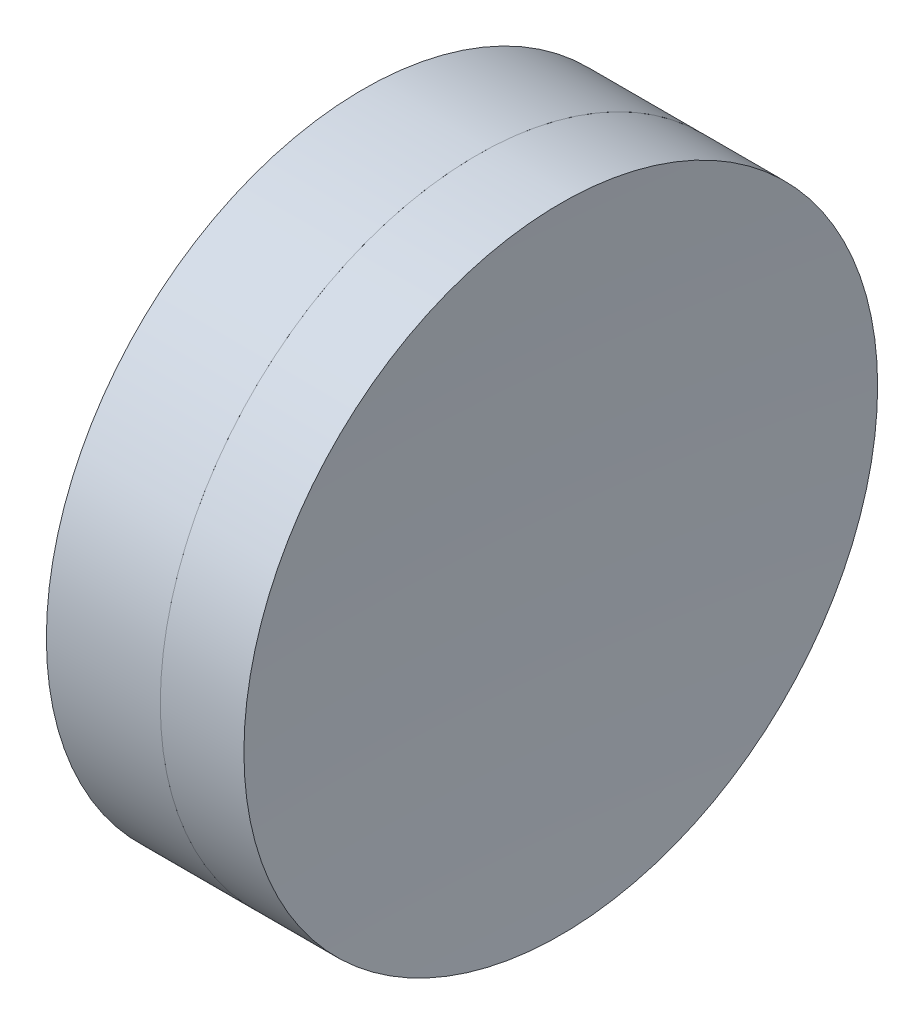
ISO-10303-21;
HEADER;
FILE_DESCRIPTION(('STEP AP214'),'2;1');
FILE_NAME('part.step','',(''),(''),'','','');
FILE_SCHEMA(('AUTOMOTIVE_DESIGN { 1 0 10303 214 1 1 1 1 }'));
ENDSEC;
DATA;
#1=APPLICATION_CONTEXT('core data for automotive mechanical design processes');
#2=APPLICATION_PROTOCOL_DEFINITION('international standard','automotive_design',2000,#1);
#3=PRODUCT_CONTEXT('',#1,'mechanical');
#4=PRODUCT('Part','Part','',(#3));
#5=PRODUCT_RELATED_PRODUCT_CATEGORY('part','',(#4));
#6=PRODUCT_DEFINITION_FORMATION('','',#4);
#7=PRODUCT_DEFINITION_CONTEXT('part definition',#1,'design');
#8=PRODUCT_DEFINITION('design','',#6,#7);
#9=PRODUCT_DEFINITION_SHAPE('','',#8);
#10=(LENGTH_UNIT() NAMED_UNIT(*) SI_UNIT(.MILLI.,.METRE.));
#11=(NAMED_UNIT(*) PLANE_ANGLE_UNIT() SI_UNIT($,.RADIAN.));
#12=(NAMED_UNIT(*) SI_UNIT($,.STERADIAN.) SOLID_ANGLE_UNIT());
#13=UNCERTAINTY_MEASURE_WITH_UNIT(LENGTH_MEASURE(1.E-05),#10,'distance_accuracy_value','');
#14=(GEOMETRIC_REPRESENTATION_CONTEXT(3) GLOBAL_UNCERTAINTY_ASSIGNED_CONTEXT((#13)) GLOBAL_UNIT_ASSIGNED_CONTEXT((#10,
#11,#12)) REPRESENTATION_CONTEXT('',''));
#15=CARTESIAN_POINT('',(0.,0.,0.));
#16=DIRECTION('',(0.,0.,1.));
#17=DIRECTION('',(1.,0.,0.));
#18=AXIS2_PLACEMENT_3D('',#15,#16,#17);
#19=CARTESIAN_POINT('',(289.408136363412,0.,0.));
#20=DIRECTION('',(-1.,0.,0.));
#21=DIRECTION('',(0.,0.,1.));
#22=AXIS2_PLACEMENT_3D('',#19,#20,#21);
#23=SPHERICAL_SURFACE('',#22,68.8700000000006);
#24=CARTESIAN_POINT('',(221.68201953984,0.,0.));
#25=DIRECTION('',(-1.,0.,0.));
#26=DIRECTION('',(0.,0.,1.));
#27=AXIS2_PLACEMENT_3D('',#24,#25,#26);
#28=CIRCLE('',#27,12.5);
#29=CARTESIAN_POINT('',(221.68201953984,0.,12.5));
#30=VERTEX_POINT('',#29);
#31=EDGE_CURVE('E11',#30,#30,#28,.T.);
#32=ORIENTED_EDGE('',*,*,#31,.T.);
#33=EDGE_LOOP('',(#32));
#34=FACE_BOUND('',#33,.T.);
#35=ADVANCED_FACE('F45',(#34),#23,.T.);
#36=CARTESIAN_POINT('',(217.187794645988,0.,0.));
#37=DIRECTION('',(-1.,0.,0.));
#38=DIRECTION('',(0.,0.,1.));
#39=AXIS2_PLACEMENT_3D('',#36,#37,#38);
#40=CYLINDRICAL_SURFACE('',#39,12.5);
#41=CARTESIAN_POINT('',(224.981180013761,0.,0.));
#42=DIRECTION('',(-1.,0.,0.));
#43=DIRECTION('',(0.,0.,1.));
#44=AXIS2_PLACEMENT_3D('',#41,#42,#43);
#45=CIRCLE('',#44,12.5);
#46=CARTESIAN_POINT('',(224.981180013761,0.,12.5));
#47=VERTEX_POINT('',#46);
#48=EDGE_CURVE('E51',#47,#47,#45,.T.);
#49=ORIENTED_EDGE('',*,*,#48,.T.);
#50=EDGE_LOOP('',(#49));
#51=FACE_BOUND('',#50,.T.);
#52=ORIENTED_EDGE('',*,*,#31,.F.);
#53=EDGE_LOOP('',(#52));
#54=FACE_BOUND('',#53,.T.);
#55=ADVANCED_FACE('F57',(#51,#54),#40,.T.);
#56=CARTESIAN_POINT('',(428.748136363411,0.,0.));
#57=DIRECTION('',(-1.,0.,0.));
#58=DIRECTION('',(0.,0.,-1.));
#59=AXIS2_PLACEMENT_3D('',#56,#57,#58);
#60=SPHERICAL_SURFACE('',#59,204.15);
#61=ORIENTED_EDGE('',*,*,#48,.F.);
#62=EDGE_LOOP('',(#61));
#63=FACE_BOUND('',#62,.T.);
#64=ADVANCED_FACE('F60',(#63),#60,.F.);
#65=CLOSED_SHELL('',(#35,#55,#64));
#66=MANIFOLD_SOLID_BREP('B2',#65);
#67=CARTESIAN_POINT('',(125.738136363412,0.,0.));
#68=DIRECTION('',(-1.,0.,0.));
#69=DIRECTION('',(0.,0.,1.));
#70=AXIS2_PLACEMENT_3D('',#67,#68,#69);
#71=SPHERICAL_SURFACE('',#70,92.3);
#72=CARTESIAN_POINT('',(217.187794645988,0.,0.));
#73=DIRECTION('',(-1.,0.,0.));
#74=DIRECTION('',(0.,0.,1.));
#75=AXIS2_PLACEMENT_3D('',#72,#73,#74);
#76=CIRCLE('',#75,12.5);
#77=CARTESIAN_POINT('',(217.187794645988,0.,12.5));
#78=VERTEX_POINT('',#77);
#79=EDGE_CURVE('E44',#78,#78,#76,.T.);
#80=ORIENTED_EDGE('',*,*,#79,.T.);
#81=EDGE_LOOP('',(#80));
#82=FACE_BOUND('',#81,.T.);
#83=ADVANCED_FACE('F86',(#82),#71,.F.);
#84=CARTESIAN_POINT('',(-0.816062176165804,0.,0.));
#85=DIRECTION('',(-1.,0.,0.));
#86=DIRECTION('',(0.,0.,1.));
#87=AXIS2_PLACEMENT_3D('',#84,#85,#86);
#88=CYLINDRICAL_SURFACE('',#87,12.5);
#89=CARTESIAN_POINT('',(221.68201953984,0.,0.));
#90=DIRECTION('',(-1.,0.,0.));
#91=DIRECTION('',(0.,0.,1.));
#92=AXIS2_PLACEMENT_3D('',#89,#90,#91);
#93=CIRCLE('',#92,12.5);
#94=CARTESIAN_POINT('',(221.68201953984,0.,12.5));
#95=VERTEX_POINT('',#94);
#96=EDGE_CURVE('E92',#95,#95,#93,.T.);
#97=ORIENTED_EDGE('',*,*,#96,.T.);
#98=EDGE_LOOP('',(#97));
#99=FACE_BOUND('',#98,.T.);
#100=ORIENTED_EDGE('',*,*,#79,.F.);
#101=EDGE_LOOP('',(#100));
#102=FACE_BOUND('',#101,.T.);
#103=ADVANCED_FACE('F98',(#99,#102),#88,.T.);
#104=CARTESIAN_POINT('',(289.408136363412,0.,0.));
#105=DIRECTION('',(-1.,0.,0.));
#106=DIRECTION('',(0.,0.,-1.));
#107=AXIS2_PLACEMENT_3D('',#104,#105,#106);
#108=SPHERICAL_SURFACE('',#107,68.8700000000006);
#109=ORIENTED_EDGE('',*,*,#96,.F.);
#110=EDGE_LOOP('',(#109));
#111=FACE_BOUND('',#110,.T.);
#112=ADVANCED_FACE('F101',(#111),#108,.F.);
#113=CLOSED_SHELL('',(#83,#103,#112));
#114=MANIFOLD_SOLID_BREP('B6',#113);
#115=ADVANCED_BREP_SHAPE_REPRESENTATION('',(#18,#66,#114),#14);
#116=SHAPE_DEFINITION_REPRESENTATION(#9,#115);
ENDSEC;
END-ISO-10303-21;
